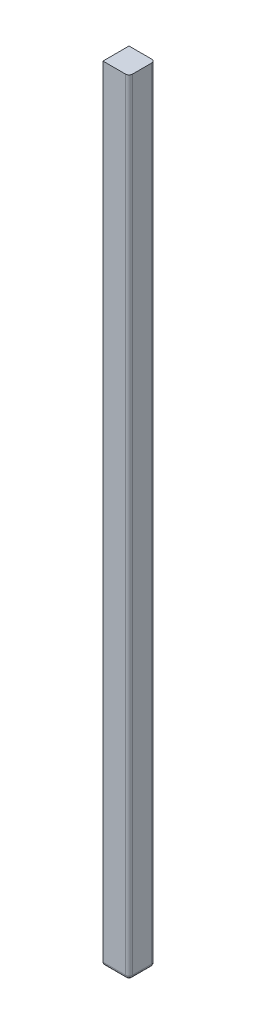
ISO-10303-21;
HEADER;
FILE_DESCRIPTION(('STEP AP214'),'2;1');
FILE_NAME('part.step','',(''),(''),'','','');
FILE_SCHEMA(('AUTOMOTIVE_DESIGN { 1 0 10303 214 1 1 1 1 }'));
ENDSEC;
DATA;
#1=APPLICATION_CONTEXT('core data for automotive mechanical design processes');
#2=APPLICATION_PROTOCOL_DEFINITION('international standard','automotive_design',2000,#1);
#3=PRODUCT_CONTEXT('',#1,'mechanical');
#4=PRODUCT('Part','Part','',(#3));
#5=PRODUCT_RELATED_PRODUCT_CATEGORY('part','',(#4));
#6=PRODUCT_DEFINITION_FORMATION('','',#4);
#7=PRODUCT_DEFINITION_CONTEXT('part definition',#1,'design');
#8=PRODUCT_DEFINITION('design','',#6,#7);
#9=PRODUCT_DEFINITION_SHAPE('','',#8);
#10=(LENGTH_UNIT() NAMED_UNIT(*) SI_UNIT(.MILLI.,.METRE.));
#11=(NAMED_UNIT(*) PLANE_ANGLE_UNIT() SI_UNIT($,.RADIAN.));
#12=(NAMED_UNIT(*) SI_UNIT($,.STERADIAN.) SOLID_ANGLE_UNIT());
#13=UNCERTAINTY_MEASURE_WITH_UNIT(LENGTH_MEASURE(1.E-05),#10,'distance_accuracy_value','');
#14=(GEOMETRIC_REPRESENTATION_CONTEXT(3) GLOBAL_UNCERTAINTY_ASSIGNED_CONTEXT((#13)) GLOBAL_UNIT_ASSIGNED_CONTEXT((#10,
#11,#12)) REPRESENTATION_CONTEXT('',''));
#15=CARTESIAN_POINT('',(0.,0.,0.));
#16=DIRECTION('',(0.,0.,1.));
#17=DIRECTION('',(1.,0.,0.));
#18=AXIS2_PLACEMENT_3D('',#15,#16,#17);
#19=CARTESIAN_POINT('',(1.9,114.3,1.9));
#20=DIRECTION('',(-1.,0.,0.));
#21=DIRECTION('',(0.,0.,1.));
#22=AXIS2_PLACEMENT_3D('',#19,#20,#21);
#23=PLANE('',#22);
#24=DIRECTION('',(0.,0.,-1.));
#25=VECTOR('',#24,1.);
#26=CARTESIAN_POINT('',(1.9,0.5,-1.9));
#27=LINE('',#26,#25);
#28=CARTESIAN_POINT('',(1.9,0.5,1.4));
#29=VERTEX_POINT('',#28);
#30=CARTESIAN_POINT('',(1.9,0.5,-1.4));
#31=VERTEX_POINT('',#30);
#32=EDGE_CURVE('E172',#29,#31,#27,.T.);
#33=ORIENTED_EDGE('',*,*,#32,.T.);
#34=DIRECTION('',(0.,-1.,0.));
#35=VECTOR('',#34,1.);
#36=CARTESIAN_POINT('',(1.9,114.3,-1.4));
#37=LINE('',#36,#35);
#38=CARTESIAN_POINT('',(1.9,114.3,-1.4));
#39=VERTEX_POINT('',#38);
#40=EDGE_CURVE('E71',#31,#39,#37,.F.);
#41=ORIENTED_EDGE('',*,*,#40,.T.);
#42=DIRECTION('',(0.,0.,-1.));
#43=VECTOR('',#42,1.);
#44=CARTESIAN_POINT('',(1.9,114.3,1.9));
#45=LINE('',#44,#43);
#46=CARTESIAN_POINT('',(1.9,114.3,1.4));
#47=VERTEX_POINT('',#46);
#48=EDGE_CURVE('E126',#47,#39,#45,.T.);
#49=ORIENTED_EDGE('',*,*,#48,.F.);
#50=DIRECTION('',(0.,-1.,0.));
#51=VECTOR('',#50,1.);
#52=CARTESIAN_POINT('',(1.9,114.3,1.4));
#53=LINE('',#52,#51);
#54=EDGE_CURVE('E200',#47,#29,#53,.T.);
#55=ORIENTED_EDGE('',*,*,#54,.T.);
#56=EDGE_LOOP('',(#33,#41,#49,#55));
#57=FACE_BOUND('',#56,.T.);
#58=ADVANCED_FACE('F47',(#57),#23,.F.);
#59=CARTESIAN_POINT('',(-1.9,114.3,-1.9));
#60=DIRECTION('',(0.,0.,1.));
#61=DIRECTION('',(1.,0.,0.));
#62=AXIS2_PLACEMENT_3D('',#59,#60,#61);
#63=PLANE('',#62);
#64=DIRECTION('',(-1.,0.,0.));
#65=VECTOR('',#64,1.);
#66=CARTESIAN_POINT('',(-1.9,114.3,-1.9));
#67=LINE('',#66,#65);
#68=CARTESIAN_POINT('',(1.4,114.3,-1.9));
#69=VERTEX_POINT('',#68);
#70=CARTESIAN_POINT('',(-1.9,114.3,-1.9));
#71=VERTEX_POINT('',#70);
#72=EDGE_CURVE('E116',#69,#71,#67,.T.);
#73=ORIENTED_EDGE('',*,*,#72,.F.);
#74=DIRECTION('',(0.,-1.,0.));
#75=VECTOR('',#74,1.);
#76=CARTESIAN_POINT('',(1.4,114.3,-1.9));
#77=LINE('',#76,#75);
#78=CARTESIAN_POINT('',(1.4,0.5,-1.9));
#79=VERTEX_POINT('',#78);
#80=EDGE_CURVE('E197',#69,#79,#77,.T.);
#81=ORIENTED_EDGE('',*,*,#80,.T.);
#82=DIRECTION('',(-1.,0.,0.));
#83=VECTOR('',#82,1.);
#84=CARTESIAN_POINT('',(-1.9,0.5,-1.9));
#85=LINE('',#84,#83);
#86=CARTESIAN_POINT('',(-1.9,0.5,-1.9));
#87=VERTEX_POINT('',#86);
#88=EDGE_CURVE('E132',#79,#87,#85,.T.);
#89=ORIENTED_EDGE('',*,*,#88,.T.);
#90=DIRECTION('',(0.,-1.,0.));
#91=VECTOR('',#90,1.);
#92=CARTESIAN_POINT('',(-1.9,114.3,-1.9));
#93=LINE('',#92,#91);
#94=EDGE_CURVE('E129',#71,#87,#93,.T.);
#95=ORIENTED_EDGE('',*,*,#94,.F.);
#96=EDGE_LOOP('',(#73,#81,#89,#95));
#97=FACE_BOUND('',#96,.T.);
#98=ADVANCED_FACE('F130',(#97),#63,.F.);
#99=CARTESIAN_POINT('',(-1.9,114.3,1.9));
#100=DIRECTION('',(1.,0.,0.));
#101=DIRECTION('',(0.,0.,-1.));
#102=AXIS2_PLACEMENT_3D('',#99,#100,#101);
#103=PLANE('',#102);
#104=ORIENTED_EDGE('',*,*,#94,.T.);
#105=DIRECTION('',(0.,0.,1.));
#106=VECTOR('',#105,1.);
#107=CARTESIAN_POINT('',(-1.9,0.5,1.9));
#108=LINE('',#107,#106);
#109=CARTESIAN_POINT('',(-1.9,0.5,1.9));
#110=VERTEX_POINT('',#109);
#111=EDGE_CURVE('E169',#87,#110,#108,.T.);
#112=ORIENTED_EDGE('',*,*,#111,.T.);
#113=DIRECTION('',(0.,-1.,0.));
#114=VECTOR('',#113,1.);
#115=CARTESIAN_POINT('',(-1.9,114.3,1.9));
#116=LINE('',#115,#114);
#117=CARTESIAN_POINT('',(-1.9,114.3,1.9));
#118=VERTEX_POINT('',#117);
#119=EDGE_CURVE('E137',#118,#110,#116,.T.);
#120=ORIENTED_EDGE('',*,*,#119,.F.);
#121=DIRECTION('',(0.,0.,1.));
#122=VECTOR('',#121,1.);
#123=CARTESIAN_POINT('',(-1.9,114.3,1.9));
#124=LINE('',#123,#122);
#125=EDGE_CURVE('E120',#71,#118,#124,.T.);
#126=ORIENTED_EDGE('',*,*,#125,.F.);
#127=EDGE_LOOP('',(#104,#112,#120,#126));
#128=FACE_BOUND('',#127,.T.);
#129=ADVANCED_FACE('F139',(#128),#103,.F.);
#130=CARTESIAN_POINT('',(-1.9,114.3,1.9));
#131=DIRECTION('',(0.,0.,-1.));
#132=DIRECTION('',(-1.,0.,0.));
#133=AXIS2_PLACEMENT_3D('',#130,#131,#132);
#134=PLANE('',#133);
#135=DIRECTION('',(1.,0.,0.));
#136=VECTOR('',#135,1.);
#137=CARTESIAN_POINT('',(1.9,0.5,1.9));
#138=LINE('',#137,#136);
#139=CARTESIAN_POINT('',(1.4,0.5,1.9));
#140=VERTEX_POINT('',#139);
#141=EDGE_CURVE('E136',#110,#140,#138,.T.);
#142=ORIENTED_EDGE('',*,*,#141,.T.);
#143=DIRECTION('',(0.,-1.,0.));
#144=VECTOR('',#143,1.);
#145=CARTESIAN_POINT('',(1.4,114.3,1.9));
#146=LINE('',#145,#144);
#147=CARTESIAN_POINT('',(1.4,114.3,1.9));
#148=VERTEX_POINT('',#147);
#149=EDGE_CURVE('E11',#140,#148,#146,.F.);
#150=ORIENTED_EDGE('',*,*,#149,.T.);
#151=DIRECTION('',(1.,0.,0.));
#152=VECTOR('',#151,1.);
#153=CARTESIAN_POINT('',(-1.9,114.3,1.9));
#154=LINE('',#153,#152);
#155=EDGE_CURVE('E142',#118,#148,#154,.T.);
#156=ORIENTED_EDGE('',*,*,#155,.F.);
#157=ORIENTED_EDGE('',*,*,#119,.T.);
#158=EDGE_LOOP('',(#142,#150,#156,#157));
#159=FACE_BOUND('',#158,.T.);
#160=ADVANCED_FACE('F227',(#159),#134,.F.);
#161=CARTESIAN_POINT('',(0.,114.3,0.));
#162=DIRECTION('',(0.,-1.,0.));
#163=DIRECTION('',(0.,0.,-1.));
#164=AXIS2_PLACEMENT_3D('',#161,#162,#163);
#165=PLANE('',#164);
#166=ORIENTED_EDGE('',*,*,#48,.T.);
#167=CARTESIAN_POINT('',(1.4,114.3,-1.4));
#168=DIRECTION('',(0.,-1.,0.));
#169=DIRECTION('',(0.,0.,-1.));
#170=AXIS2_PLACEMENT_3D('',#167,#168,#169);
#171=CIRCLE('',#170,0.5);
#172=EDGE_CURVE('E57',#39,#69,#171,.F.);
#173=ORIENTED_EDGE('',*,*,#172,.T.);
#174=ORIENTED_EDGE('',*,*,#72,.T.);
#175=ORIENTED_EDGE('',*,*,#125,.T.);
#176=ORIENTED_EDGE('',*,*,#155,.T.);
#177=CARTESIAN_POINT('',(1.4,114.3,1.4));
#178=DIRECTION('',(0.,-1.,0.));
#179=DIRECTION('',(0.,0.,-1.));
#180=AXIS2_PLACEMENT_3D('',#177,#178,#179);
#181=CIRCLE('',#180,0.5);
#182=EDGE_CURVE('E205',#148,#47,#181,.F.);
#183=ORIENTED_EDGE('',*,*,#182,.T.);
#184=EDGE_LOOP('',(#166,#173,#174,#175,#176,#183));
#185=FACE_BOUND('',#184,.T.);
#186=ADVANCED_FACE('F118',(#185),#165,.F.);
#187=CARTESIAN_POINT('',(0.,0.,0.));
#188=DIRECTION('',(0.,-1.,0.));
#189=DIRECTION('',(0.,0.,-1.));
#190=AXIS2_PLACEMENT_3D('',#187,#188,#189);
#191=PLANE('',#190);
#192=DIRECTION('',(1.,0.,0.));
#193=VECTOR('',#192,1.);
#194=CARTESIAN_POINT('',(-1.9,0.,1.4));
#195=LINE('',#194,#193);
#196=CARTESIAN_POINT('',(1.4,0.,1.4));
#197=VERTEX_POINT('',#196);
#198=CARTESIAN_POINT('',(-1.4,0.,1.4));
#199=VERTEX_POINT('',#198);
#200=EDGE_CURVE('E160',#197,#199,#195,.F.);
#201=ORIENTED_EDGE('',*,*,#200,.T.);
#202=DIRECTION('',(0.,0.,1.));
#203=VECTOR('',#202,1.);
#204=CARTESIAN_POINT('',(-1.4,0.,-1.9));
#205=LINE('',#204,#203);
#206=CARTESIAN_POINT('',(-1.4,0.,-1.4));
#207=VERTEX_POINT('',#206);
#208=EDGE_CURVE('E164',#199,#207,#205,.F.);
#209=ORIENTED_EDGE('',*,*,#208,.T.);
#210=DIRECTION('',(-1.,0.,0.));
#211=VECTOR('',#210,1.);
#212=CARTESIAN_POINT('',(1.9,0.,-1.4));
#213=LINE('',#212,#211);
#214=CARTESIAN_POINT('',(1.4,0.,-1.4));
#215=VERTEX_POINT('',#214);
#216=EDGE_CURVE('E156',#207,#215,#213,.F.);
#217=ORIENTED_EDGE('',*,*,#216,.T.);
#218=DIRECTION('',(0.,0.,-1.));
#219=VECTOR('',#218,1.);
#220=CARTESIAN_POINT('',(1.4,0.,1.9));
#221=LINE('',#220,#219);
#222=EDGE_CURVE('E152',#215,#197,#221,.F.);
#223=ORIENTED_EDGE('',*,*,#222,.T.);
#224=EDGE_LOOP('',(#201,#209,#217,#223));
#225=FACE_BOUND('',#224,.T.);
#226=ADVANCED_FACE('F235',(#225),#191,.T.);
#227=CARTESIAN_POINT('',(-1.9,0.5,-1.4));
#228=DIRECTION('',(1.,0.,0.));
#229=DIRECTION('',(0.,0.,-1.));
#230=AXIS2_PLACEMENT_3D('',#227,#228,#229);
#231=CYLINDRICAL_SURFACE('',#230,0.5);
#232=ORIENTED_EDGE('',*,*,#88,.F.);
#233=CARTESIAN_POINT('',(1.4,0.5,-1.4));
#234=DIRECTION('',(1.,0.,0.));
#235=DIRECTION('',(0.,0.,-1.));
#236=AXIS2_PLACEMENT_3D('',#233,#234,#235);
#237=CIRCLE('',#236,0.5);
#238=EDGE_CURVE('E190',#79,#215,#237,.F.);
#239=ORIENTED_EDGE('',*,*,#238,.T.);
#240=ORIENTED_EDGE('',*,*,#216,.F.);
#241=CARTESIAN_POINT('',(-1.4,0.5,-1.4));
#242=DIRECTION('',(0.707106781186547,0.,-0.707106781186547));
#243=DIRECTION('',(-0.707106781186547,0.,-0.707106781186547));
#244=AXIS2_PLACEMENT_3D('',#241,#242,#243);
#245=ELLIPSE('',#244,0.707106781186547,0.5);
#246=EDGE_CURVE('E179',#87,#207,#245,.F.);
#247=ORIENTED_EDGE('',*,*,#246,.F.);
#248=EDGE_LOOP('',(#232,#239,#240,#247));
#249=FACE_BOUND('',#248,.T.);
#250=ADVANCED_FACE('F244',(#249),#231,.T.);
#251=CARTESIAN_POINT('',(-1.4,0.5,1.9));
#252=DIRECTION('',(0.,0.,-1.));
#253=DIRECTION('',(-1.,0.,0.));
#254=AXIS2_PLACEMENT_3D('',#251,#252,#253);
#255=CYLINDRICAL_SURFACE('',#254,0.5);
#256=ORIENTED_EDGE('',*,*,#246,.T.);
#257=ORIENTED_EDGE('',*,*,#208,.F.);
#258=CARTESIAN_POINT('',(-1.4,0.5,1.4));
#259=DIRECTION('',(-0.707106781186547,0.,-0.707106781186547));
#260=DIRECTION('',(0.707106781186547,0.,-0.707106781186547));
#261=AXIS2_PLACEMENT_3D('',#258,#259,#260);
#262=ELLIPSE('',#261,0.707106781186547,0.5);
#263=EDGE_CURVE('E176',#110,#199,#262,.F.);
#264=ORIENTED_EDGE('',*,*,#263,.F.);
#265=ORIENTED_EDGE('',*,*,#111,.F.);
#266=EDGE_LOOP('',(#256,#257,#264,#265));
#267=FACE_BOUND('',#266,.T.);
#268=ADVANCED_FACE('F232',(#267),#255,.T.);
#269=CARTESIAN_POINT('',(1.4,0.5,1.9));
#270=DIRECTION('',(0.,0.,1.));
#271=DIRECTION('',(1.,0.,0.));
#272=AXIS2_PLACEMENT_3D('',#269,#270,#271);
#273=CYLINDRICAL_SURFACE('',#272,0.5);
#274=ORIENTED_EDGE('',*,*,#222,.F.);
#275=CARTESIAN_POINT('',(1.4,0.5,-1.4));
#276=DIRECTION('',(0.,0.,1.));
#277=DIRECTION('',(1.,0.,0.));
#278=AXIS2_PLACEMENT_3D('',#275,#276,#277);
#279=CIRCLE('',#278,0.5);
#280=EDGE_CURVE('E186',#215,#31,#279,.T.);
#281=ORIENTED_EDGE('',*,*,#280,.T.);
#282=ORIENTED_EDGE('',*,*,#32,.F.);
#283=CARTESIAN_POINT('',(1.4,0.5,1.4));
#284=DIRECTION('',(0.,0.,1.));
#285=DIRECTION('',(1.,0.,0.));
#286=AXIS2_PLACEMENT_3D('',#283,#284,#285);
#287=CIRCLE('',#286,0.5);
#288=EDGE_CURVE('E175',#29,#197,#287,.F.);
#289=ORIENTED_EDGE('',*,*,#288,.T.);
#290=EDGE_LOOP('',(#274,#281,#282,#289));
#291=FACE_BOUND('',#290,.T.);
#292=ADVANCED_FACE('F238',(#291),#273,.T.);
#293=CARTESIAN_POINT('',(-1.9,0.5,1.4));
#294=DIRECTION('',(-1.,0.,0.));
#295=DIRECTION('',(0.,0.,1.));
#296=AXIS2_PLACEMENT_3D('',#293,#294,#295);
#297=CYLINDRICAL_SURFACE('',#296,0.5);
#298=ORIENTED_EDGE('',*,*,#200,.F.);
#299=CARTESIAN_POINT('',(1.4,0.5,1.4));
#300=DIRECTION('',(-1.,0.,0.));
#301=DIRECTION('',(0.,0.,1.));
#302=AXIS2_PLACEMENT_3D('',#299,#300,#301);
#303=CIRCLE('',#302,0.5);
#304=EDGE_CURVE('E193',#197,#140,#303,.T.);
#305=ORIENTED_EDGE('',*,*,#304,.T.);
#306=ORIENTED_EDGE('',*,*,#141,.F.);
#307=ORIENTED_EDGE('',*,*,#263,.T.);
#308=EDGE_LOOP('',(#298,#305,#306,#307));
#309=FACE_BOUND('',#308,.T.);
#310=ADVANCED_FACE('F226',(#309),#297,.T.);
#311=CARTESIAN_POINT('',(1.4,114.3,-1.4));
#312=DIRECTION('',(0.,-1.,0.));
#313=DIRECTION('',(0.,0.,-1.));
#314=AXIS2_PLACEMENT_3D('',#311,#312,#313);
#315=CYLINDRICAL_SURFACE('',#314,0.5);
#316=ORIENTED_EDGE('',*,*,#172,.F.);
#317=ORIENTED_EDGE('',*,*,#40,.F.);
#318=CARTESIAN_POINT('',(1.4,0.5,-1.4));
#319=DIRECTION('',(0.,-1.,0.));
#320=DIRECTION('',(0.,0.,-1.));
#321=AXIS2_PLACEMENT_3D('',#318,#319,#320);
#322=CIRCLE('',#321,0.5);
#323=EDGE_CURVE('E180',#79,#31,#322,.T.);
#324=ORIENTED_EDGE('',*,*,#323,.F.);
#325=ORIENTED_EDGE('',*,*,#80,.F.);
#326=EDGE_LOOP('',(#316,#317,#324,#325));
#327=FACE_BOUND('',#326,.T.);
#328=ADVANCED_FACE('F243',(#327),#315,.T.);
#329=CARTESIAN_POINT('',(1.4,0.5,-1.4));
#330=DIRECTION('',(0.,0.,1.));
#331=DIRECTION('',(1.,0.,0.));
#332=AXIS2_PLACEMENT_3D('',#329,#330,#331);
#333=SPHERICAL_SURFACE('',#332,0.5);
#334=ORIENTED_EDGE('',*,*,#280,.F.);
#335=ORIENTED_EDGE('',*,*,#238,.F.);
#336=ORIENTED_EDGE('',*,*,#323,.T.);
#337=EDGE_LOOP('',(#334,#335,#336));
#338=FACE_BOUND('',#337,.T.);
#339=ADVANCED_FACE('F240',(#338),#333,.T.);
#340=CARTESIAN_POINT('',(1.4,114.3,1.4));
#341=DIRECTION('',(0.,-1.,0.));
#342=DIRECTION('',(0.,0.,-1.));
#343=AXIS2_PLACEMENT_3D('',#340,#341,#342);
#344=CYLINDRICAL_SURFACE('',#343,0.5);
#345=ORIENTED_EDGE('',*,*,#182,.F.);
#346=ORIENTED_EDGE('',*,*,#149,.F.);
#347=CARTESIAN_POINT('',(1.4,0.5,1.4));
#348=DIRECTION('',(0.,-1.,0.));
#349=DIRECTION('',(0.,0.,-1.));
#350=AXIS2_PLACEMENT_3D('',#347,#348,#349);
#351=CIRCLE('',#350,0.5);
#352=EDGE_CURVE('E51',#29,#140,#351,.T.);
#353=ORIENTED_EDGE('',*,*,#352,.F.);
#354=ORIENTED_EDGE('',*,*,#54,.F.);
#355=EDGE_LOOP('',(#345,#346,#353,#354));
#356=FACE_BOUND('',#355,.T.);
#357=ADVANCED_FACE('F49',(#356),#344,.T.);
#358=CARTESIAN_POINT('',(1.4,0.5,1.4));
#359=DIRECTION('',(0.,0.,1.));
#360=DIRECTION('',(1.,0.,0.));
#361=AXIS2_PLACEMENT_3D('',#358,#359,#360);
#362=SPHERICAL_SURFACE('',#361,0.5);
#363=ORIENTED_EDGE('',*,*,#304,.F.);
#364=ORIENTED_EDGE('',*,*,#288,.F.);
#365=ORIENTED_EDGE('',*,*,#352,.T.);
#366=EDGE_LOOP('',(#363,#364,#365));
#367=FACE_BOUND('',#366,.T.);
#368=ADVANCED_FACE('F219',(#367),#362,.T.);
#369=CLOSED_SHELL('',(#58,#98,#129,#160,#186,#226,#250,#268,#292,#310,#328,#339,#357,#368));
#370=MANIFOLD_SOLID_BREP('B2',#369);
#371=ADVANCED_BREP_SHAPE_REPRESENTATION('',(#18,#370),#14);
#372=SHAPE_DEFINITION_REPRESENTATION(#9,#371);
ENDSEC;
END-ISO-10303-21;
